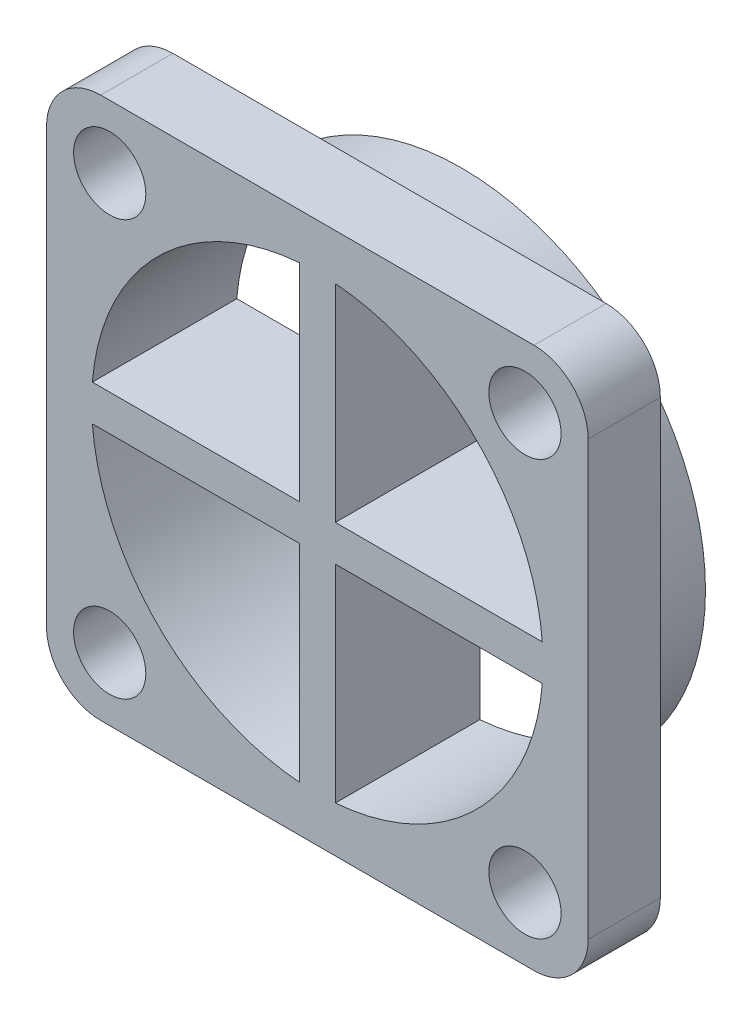
ISO-10303-21;
HEADER;
FILE_DESCRIPTION(('STEP AP214'),'2;1');
FILE_NAME('part.step','',(''),(''),'','','');
FILE_SCHEMA(('AUTOMOTIVE_DESIGN { 1 0 10303 214 1 1 1 1 }'));
ENDSEC;
DATA;
#1=APPLICATION_CONTEXT('core data for automotive mechanical design processes');
#2=APPLICATION_PROTOCOL_DEFINITION('international standard','automotive_design',2000,#1);
#3=PRODUCT_CONTEXT('',#1,'mechanical');
#4=PRODUCT('Part','Part','',(#3));
#5=PRODUCT_RELATED_PRODUCT_CATEGORY('part','',(#4));
#6=PRODUCT_DEFINITION_FORMATION('','',#4);
#7=PRODUCT_DEFINITION_CONTEXT('part definition',#1,'design');
#8=PRODUCT_DEFINITION('design','',#6,#7);
#9=PRODUCT_DEFINITION_SHAPE('','',#8);
#10=(LENGTH_UNIT() NAMED_UNIT(*) SI_UNIT(.MILLI.,.METRE.));
#11=(NAMED_UNIT(*) PLANE_ANGLE_UNIT() SI_UNIT($,.RADIAN.));
#12=(NAMED_UNIT(*) SI_UNIT($,.STERADIAN.) SOLID_ANGLE_UNIT());
#13=UNCERTAINTY_MEASURE_WITH_UNIT(LENGTH_MEASURE(1.E-05),#10,'distance_accuracy_value','');
#14=(GEOMETRIC_REPRESENTATION_CONTEXT(3) GLOBAL_UNCERTAINTY_ASSIGNED_CONTEXT((#13)) GLOBAL_UNIT_ASSIGNED_CONTEXT((#10,
#11,#12)) REPRESENTATION_CONTEXT('',''));
#15=CARTESIAN_POINT('',(0.,0.,0.));
#16=DIRECTION('',(0.,0.,1.));
#17=DIRECTION('',(1.,0.,0.));
#18=AXIS2_PLACEMENT_3D('',#15,#16,#17);
#19=CARTESIAN_POINT('',(0.,0.,8.));
#20=DIRECTION('',(0.,0.,1.));
#21=DIRECTION('',(1.,0.,0.));
#22=AXIS2_PLACEMENT_3D('',#19,#20,#21);
#23=PLANE('',#22);
#24=CARTESIAN_POINT('',(11.5,-11.5,8.));
#25=DIRECTION('',(0.,0.,1.));
#26=DIRECTION('',(1.,0.,0.));
#27=AXIS2_PLACEMENT_3D('',#24,#25,#26);
#28=CIRCLE('',#27,2.);
#29=CARTESIAN_POINT('',(13.5,-11.5,8.));
#30=VERTEX_POINT('',#29);
#31=EDGE_CURVE('E616',#30,#30,#28,.F.);
#32=ORIENTED_EDGE('',*,*,#31,.T.);
#33=EDGE_LOOP('',(#32));
#34=FACE_BOUND('',#33,.T.);
#35=CARTESIAN_POINT('',(11.5,11.5,8.));
#36=DIRECTION('',(0.,0.,1.));
#37=DIRECTION('',(1.,0.,0.));
#38=AXIS2_PLACEMENT_3D('',#35,#36,#37);
#39=CIRCLE('',#38,2.);
#40=CARTESIAN_POINT('',(13.5,11.5,8.));
#41=VERTEX_POINT('',#40);
#42=EDGE_CURVE('E183',#41,#41,#39,.T.);
#43=ORIENTED_EDGE('',*,*,#42,.F.);
#44=EDGE_LOOP('',(#43));
#45=FACE_BOUND('',#44,.T.);
#46=DIRECTION('',(1.,0.,0.));
#47=VECTOR('',#46,1.);
#48=CARTESIAN_POINT('',(-12.4599357943771,1.,8.));
#49=LINE('',#48,#47);
#50=CARTESIAN_POINT('',(-12.4599357943771,1.,8.));
#51=VERTEX_POINT('',#50);
#52=CARTESIAN_POINT('',(-1.,1.,8.));
#53=VERTEX_POINT('',#52);
#54=EDGE_CURVE('E229',#51,#53,#49,.T.);
#55=ORIENTED_EDGE('',*,*,#54,.F.);
#56=CARTESIAN_POINT('',(0.,0.,8.));
#57=DIRECTION('',(0.,0.,1.));
#58=DIRECTION('',(1.,0.,0.));
#59=AXIS2_PLACEMENT_3D('',#56,#57,#58);
#60=CIRCLE('',#59,12.5);
#61=CARTESIAN_POINT('',(-1.,12.4599357943771,8.));
#62=VERTEX_POINT('',#61);
#63=EDGE_CURVE('E225',#62,#51,#60,.T.);
#64=ORIENTED_EDGE('',*,*,#63,.F.);
#65=DIRECTION('',(0.,1.,0.));
#66=VECTOR('',#65,1.);
#67=CARTESIAN_POINT('',(-1.,1.,8.));
#68=LINE('',#67,#66);
#69=EDGE_CURVE('E227',#53,#62,#68,.T.);
#70=ORIENTED_EDGE('',*,*,#69,.F.);
#71=EDGE_LOOP('',(#55,#64,#70));
#72=FACE_BOUND('',#71,.T.);
#73=CARTESIAN_POINT('',(0.,0.,8.));
#74=DIRECTION('',(0.,0.,-1.));
#75=DIRECTION('',(-1.,0.,0.));
#76=AXIS2_PLACEMENT_3D('',#73,#74,#75);
#77=CIRCLE('',#76,12.5);
#78=CARTESIAN_POINT('',(1.,12.4599357943771,8.));
#79=VERTEX_POINT('',#78);
#80=CARTESIAN_POINT('',(12.4599357943771,1.,8.));
#81=VERTEX_POINT('',#80);
#82=EDGE_CURVE('E247',#79,#81,#77,.T.);
#83=ORIENTED_EDGE('',*,*,#82,.T.);
#84=DIRECTION('',(-1.,0.,0.));
#85=VECTOR('',#84,1.);
#86=CARTESIAN_POINT('',(12.4599357943771,1.,8.));
#87=LINE('',#86,#85);
#88=CARTESIAN_POINT('',(1.,1.,8.));
#89=VERTEX_POINT('',#88);
#90=EDGE_CURVE('E250',#81,#89,#87,.T.);
#91=ORIENTED_EDGE('',*,*,#90,.T.);
#92=DIRECTION('',(0.,1.,0.));
#93=VECTOR('',#92,1.);
#94=CARTESIAN_POINT('',(1.,1.,8.));
#95=LINE('',#94,#93);
#96=EDGE_CURVE('E253',#89,#79,#95,.T.);
#97=ORIENTED_EDGE('',*,*,#96,.T.);
#98=EDGE_LOOP('',(#83,#91,#97));
#99=FACE_BOUND('',#98,.T.);
#100=DIRECTION('',(1.,0.,0.));
#101=VECTOR('',#100,1.);
#102=CARTESIAN_POINT('',(-15.,-15.,8.));
#103=LINE('',#102,#101);
#104=CARTESIAN_POINT('',(-12.,-15.,8.));
#105=VERTEX_POINT('',#104);
#106=CARTESIAN_POINT('',(12.,-15.,8.));
#107=VERTEX_POINT('',#106);
#108=EDGE_CURVE('E284',#105,#107,#103,.T.);
#109=ORIENTED_EDGE('',*,*,#108,.T.);
#110=CARTESIAN_POINT('',(12.,-12.,8.));
#111=DIRECTION('',(0.,0.,1.));
#112=DIRECTION('',(1.,0.,0.));
#113=AXIS2_PLACEMENT_3D('',#110,#111,#112);
#114=CIRCLE('',#113,3.);
#115=CARTESIAN_POINT('',(15.,-12.,8.));
#116=VERTEX_POINT('',#115);
#117=EDGE_CURVE('E327',#107,#116,#114,.T.);
#118=ORIENTED_EDGE('',*,*,#117,.T.);
#119=DIRECTION('',(0.,1.,0.));
#120=VECTOR('',#119,1.);
#121=CARTESIAN_POINT('',(15.,15.,8.));
#122=LINE('',#121,#120);
#123=CARTESIAN_POINT('',(15.,12.,8.));
#124=VERTEX_POINT('',#123);
#125=EDGE_CURVE('E274',#116,#124,#122,.T.);
#126=ORIENTED_EDGE('',*,*,#125,.T.);
#127=CARTESIAN_POINT('',(12.,12.,8.));
#128=DIRECTION('',(0.,0.,1.));
#129=DIRECTION('',(1.,0.,0.));
#130=AXIS2_PLACEMENT_3D('',#127,#128,#129);
#131=CIRCLE('',#130,3.);
#132=CARTESIAN_POINT('',(12.,15.,8.));
#133=VERTEX_POINT('',#132);
#134=EDGE_CURVE('E321',#124,#133,#131,.T.);
#135=ORIENTED_EDGE('',*,*,#134,.T.);
#136=DIRECTION('',(-1.,0.,0.));
#137=VECTOR('',#136,1.);
#138=CARTESIAN_POINT('',(-15.,15.,8.));
#139=LINE('',#138,#137);
#140=CARTESIAN_POINT('',(-12.,15.,8.));
#141=VERTEX_POINT('',#140);
#142=EDGE_CURVE('E277',#133,#141,#139,.T.);
#143=ORIENTED_EDGE('',*,*,#142,.T.);
#144=CARTESIAN_POINT('',(-12.,12.,8.));
#145=DIRECTION('',(0.,0.,1.));
#146=DIRECTION('',(1.,0.,0.));
#147=AXIS2_PLACEMENT_3D('',#144,#145,#146);
#148=CIRCLE('',#147,3.);
#149=CARTESIAN_POINT('',(-15.,12.,8.));
#150=VERTEX_POINT('',#149);
#151=EDGE_CURVE('E323',#141,#150,#148,.T.);
#152=ORIENTED_EDGE('',*,*,#151,.T.);
#153=DIRECTION('',(0.,-1.,0.));
#154=VECTOR('',#153,1.);
#155=CARTESIAN_POINT('',(-15.,15.,8.));
#156=LINE('',#155,#154);
#157=CARTESIAN_POINT('',(-15.,-12.,8.));
#158=VERTEX_POINT('',#157);
#159=EDGE_CURVE('E281',#150,#158,#156,.T.);
#160=ORIENTED_EDGE('',*,*,#159,.T.);
#161=CARTESIAN_POINT('',(-12.,-12.,8.));
#162=DIRECTION('',(0.,0.,1.));
#163=DIRECTION('',(1.,0.,0.));
#164=AXIS2_PLACEMENT_3D('',#161,#162,#163);
#165=CIRCLE('',#164,3.);
#166=EDGE_CURVE('E325',#158,#105,#165,.T.);
#167=ORIENTED_EDGE('',*,*,#166,.T.);
#168=EDGE_LOOP('',(#109,#118,#126,#135,#143,#152,#160,#167));
#169=FACE_BOUND('',#168,.T.);
#170=CARTESIAN_POINT('',(0.,0.,8.));
#171=DIRECTION('',(0.,0.,-1.));
#172=DIRECTION('',(1.,0.,0.));
#173=AXIS2_PLACEMENT_3D('',#170,#171,#172);
#174=CIRCLE('',#173,12.5);
#175=CARTESIAN_POINT('',(-1.,-12.4599357943771,8.));
#176=VERTEX_POINT('',#175);
#177=CARTESIAN_POINT('',(-12.4599357943771,-1.,8.));
#178=VERTEX_POINT('',#177);
#179=EDGE_CURVE('E199',#176,#178,#174,.T.);
#180=ORIENTED_EDGE('',*,*,#179,.T.);
#181=DIRECTION('',(1.,0.,0.));
#182=VECTOR('',#181,1.);
#183=CARTESIAN_POINT('',(-12.4599357943771,-1.,8.));
#184=LINE('',#183,#182);
#185=CARTESIAN_POINT('',(-1.,-1.,8.));
#186=VERTEX_POINT('',#185);
#187=EDGE_CURVE('E202',#178,#186,#184,.T.);
#188=ORIENTED_EDGE('',*,*,#187,.T.);
#189=DIRECTION('',(0.,-1.,0.));
#190=VECTOR('',#189,1.);
#191=CARTESIAN_POINT('',(-1.,-1.,8.));
#192=LINE('',#191,#190);
#193=EDGE_CURVE('E205',#186,#176,#192,.T.);
#194=ORIENTED_EDGE('',*,*,#193,.T.);
#195=EDGE_LOOP('',(#180,#188,#194));
#196=FACE_BOUND('',#195,.T.);
#197=DIRECTION('',(-1.,0.,0.));
#198=VECTOR('',#197,1.);
#199=CARTESIAN_POINT('',(12.4599357943771,-1.,8.));
#200=LINE('',#199,#198);
#201=CARTESIAN_POINT('',(12.4599357943771,-1.,8.));
#202=VERTEX_POINT('',#201);
#203=CARTESIAN_POINT('',(1.,-1.,8.));
#204=VERTEX_POINT('',#203);
#205=EDGE_CURVE('E171',#202,#204,#200,.T.);
#206=ORIENTED_EDGE('',*,*,#205,.F.);
#207=CARTESIAN_POINT('',(0.,0.,8.));
#208=DIRECTION('',(0.,0.,1.));
#209=DIRECTION('',(-1.,0.,0.));
#210=AXIS2_PLACEMENT_3D('',#207,#208,#209);
#211=CIRCLE('',#210,12.5);
#212=CARTESIAN_POINT('',(1.,-12.4599357943771,8.));
#213=VERTEX_POINT('',#212);
#214=EDGE_CURVE('E172',#213,#202,#211,.T.);
#215=ORIENTED_EDGE('',*,*,#214,.F.);
#216=DIRECTION('',(0.,-1.,0.));
#217=VECTOR('',#216,1.);
#218=CARTESIAN_POINT('',(1.,-1.,8.));
#219=LINE('',#218,#217);
#220=EDGE_CURVE('E166',#204,#213,#219,.T.);
#221=ORIENTED_EDGE('',*,*,#220,.F.);
#222=EDGE_LOOP('',(#206,#215,#221));
#223=FACE_BOUND('',#222,.T.);
#224=CARTESIAN_POINT('',(-11.5,-11.5,8.));
#225=DIRECTION('',(0.,0.,1.));
#226=DIRECTION('',(1.,0.,0.));
#227=AXIS2_PLACEMENT_3D('',#224,#225,#226);
#228=CIRCLE('',#227,2.);
#229=CARTESIAN_POINT('',(-9.5,-11.5,8.));
#230=VERTEX_POINT('',#229);
#231=EDGE_CURVE('E610',#230,#230,#228,.T.);
#232=ORIENTED_EDGE('',*,*,#231,.F.);
#233=EDGE_LOOP('',(#232));
#234=FACE_BOUND('',#233,.T.);
#235=CARTESIAN_POINT('',(-11.5,11.5,8.));
#236=DIRECTION('',(0.,0.,1.));
#237=DIRECTION('',(1.,0.,0.));
#238=AXIS2_PLACEMENT_3D('',#235,#236,#237);
#239=CIRCLE('',#238,2.);
#240=CARTESIAN_POINT('',(-9.5,11.5,8.));
#241=VERTEX_POINT('',#240);
#242=EDGE_CURVE('E599',#241,#241,#239,.F.);
#243=ORIENTED_EDGE('',*,*,#242,.T.);
#244=EDGE_LOOP('',(#243));
#245=FACE_BOUND('',#244,.T.);
#246=ADVANCED_FACE('F33',(#34,#45,#72,#99,#169,#196,#223,#234,#245),#23,.T.);
#247=CARTESIAN_POINT('',(0.,0.,4.));
#248=DIRECTION('',(0.,0.,1.));
#249=DIRECTION('',(1.,0.,0.));
#250=AXIS2_PLACEMENT_3D('',#247,#248,#249);
#251=PLANE('',#250);
#252=CARTESIAN_POINT('',(11.5,-11.5,4.));
#253=DIRECTION('',(0.,0.,1.));
#254=DIRECTION('',(-1.,0.,0.));
#255=AXIS2_PLACEMENT_3D('',#252,#253,#254);
#256=CIRCLE('',#255,2.);
#257=CARTESIAN_POINT('',(9.5,-11.5,4.));
#258=VERTEX_POINT('',#257);
#259=EDGE_CURVE('E613',#258,#258,#256,.T.);
#260=ORIENTED_EDGE('',*,*,#259,.T.);
#261=EDGE_LOOP('',(#260));
#262=FACE_BOUND('',#261,.T.);
#263=CARTESIAN_POINT('',(11.5,11.5,4.));
#264=DIRECTION('',(0.,0.,-1.));
#265=DIRECTION('',(-1.,0.,0.));
#266=AXIS2_PLACEMENT_3D('',#263,#264,#265);
#267=CIRCLE('',#266,2.);
#268=CARTESIAN_POINT('',(9.5,11.5,4.));
#269=VERTEX_POINT('',#268);
#270=EDGE_CURVE('E186',#269,#269,#267,.T.);
#271=ORIENTED_EDGE('',*,*,#270,.F.);
#272=EDGE_LOOP('',(#271));
#273=FACE_BOUND('',#272,.T.);
#274=DIRECTION('',(0.,1.,0.));
#275=VECTOR('',#274,1.);
#276=CARTESIAN_POINT('',(15.,15.,4.));
#277=LINE('',#276,#275);
#278=CARTESIAN_POINT('',(15.,-12.,4.));
#279=VERTEX_POINT('',#278);
#280=CARTESIAN_POINT('',(15.,12.,4.));
#281=VERTEX_POINT('',#280);
#282=EDGE_CURVE('E273',#279,#281,#277,.T.);
#283=ORIENTED_EDGE('',*,*,#282,.F.);
#284=CARTESIAN_POINT('',(12.,-12.,4.));
#285=DIRECTION('',(0.,0.,1.));
#286=DIRECTION('',(1.,0.,0.));
#287=AXIS2_PLACEMENT_3D('',#284,#285,#286);
#288=CIRCLE('',#287,3.);
#289=CARTESIAN_POINT('',(12.,-15.,4.));
#290=VERTEX_POINT('',#289);
#291=EDGE_CURVE('E314',#279,#290,#288,.F.);
#292=ORIENTED_EDGE('',*,*,#291,.T.);
#293=DIRECTION('',(1.,0.,0.));
#294=VECTOR('',#293,1.);
#295=CARTESIAN_POINT('',(-15.,-15.,4.));
#296=LINE('',#295,#294);
#297=CARTESIAN_POINT('',(-12.,-15.,4.));
#298=VERTEX_POINT('',#297);
#299=EDGE_CURVE('E278',#298,#290,#296,.T.);
#300=ORIENTED_EDGE('',*,*,#299,.F.);
#301=CARTESIAN_POINT('',(-12.,-12.,4.));
#302=DIRECTION('',(0.,0.,1.));
#303=DIRECTION('',(1.,0.,0.));
#304=AXIS2_PLACEMENT_3D('',#301,#302,#303);
#305=CIRCLE('',#304,3.);
#306=CARTESIAN_POINT('',(-15.,-12.,4.));
#307=VERTEX_POINT('',#306);
#308=EDGE_CURVE('E312',#298,#307,#305,.F.);
#309=ORIENTED_EDGE('',*,*,#308,.T.);
#310=DIRECTION('',(0.,-1.,0.));
#311=VECTOR('',#310,1.);
#312=CARTESIAN_POINT('',(-15.,15.,4.));
#313=LINE('',#312,#311);
#314=CARTESIAN_POINT('',(-15.,12.,4.));
#315=VERTEX_POINT('',#314);
#316=EDGE_CURVE('E293',#315,#307,#313,.T.);
#317=ORIENTED_EDGE('',*,*,#316,.F.);
#318=CARTESIAN_POINT('',(-12.,12.,4.));
#319=DIRECTION('',(0.,0.,1.));
#320=DIRECTION('',(1.,0.,0.));
#321=AXIS2_PLACEMENT_3D('',#318,#319,#320);
#322=CIRCLE('',#321,3.);
#323=CARTESIAN_POINT('',(-12.,15.,4.));
#324=VERTEX_POINT('',#323);
#325=EDGE_CURVE('E310',#315,#324,#322,.F.);
#326=ORIENTED_EDGE('',*,*,#325,.T.);
#327=DIRECTION('',(-1.,0.,0.));
#328=VECTOR('',#327,1.);
#329=CARTESIAN_POINT('',(-15.,15.,4.));
#330=LINE('',#329,#328);
#331=CARTESIAN_POINT('',(12.,15.,4.));
#332=VERTEX_POINT('',#331);
#333=EDGE_CURVE('E290',#332,#324,#330,.T.);
#334=ORIENTED_EDGE('',*,*,#333,.F.);
#335=CARTESIAN_POINT('',(12.,12.,4.));
#336=DIRECTION('',(0.,0.,1.));
#337=DIRECTION('',(1.,0.,0.));
#338=AXIS2_PLACEMENT_3D('',#335,#336,#337);
#339=CIRCLE('',#338,3.);
#340=EDGE_CURVE('E308',#332,#281,#339,.F.);
#341=ORIENTED_EDGE('',*,*,#340,.T.);
#342=EDGE_LOOP('',(#283,#292,#300,#309,#317,#326,#334,#341));
#343=FACE_BOUND('',#342,.T.);
#344=CARTESIAN_POINT('',(0.,0.,4.));
#345=DIRECTION('',(0.,0.,1.));
#346=DIRECTION('',(1.,0.,0.));
#347=AXIS2_PLACEMENT_3D('',#344,#345,#346);
#348=CIRCLE('',#347,13.5);
#349=CARTESIAN_POINT('',(13.5,0.,4.));
#350=VERTEX_POINT('',#349);
#351=EDGE_CURVE('E298',#350,#350,#348,.T.);
#352=ORIENTED_EDGE('',*,*,#351,.T.);
#353=EDGE_LOOP('',(#352));
#354=FACE_BOUND('',#353,.T.);
#355=CARTESIAN_POINT('',(-11.5,-11.5,4.));
#356=DIRECTION('',(0.,0.,-1.));
#357=DIRECTION('',(1.,0.,0.));
#358=AXIS2_PLACEMENT_3D('',#355,#356,#357);
#359=CIRCLE('',#358,2.);
#360=CARTESIAN_POINT('',(-9.5,-11.5,4.));
#361=VERTEX_POINT('',#360);
#362=EDGE_CURVE('E605',#361,#361,#359,.T.);
#363=ORIENTED_EDGE('',*,*,#362,.F.);
#364=EDGE_LOOP('',(#363));
#365=FACE_BOUND('',#364,.T.);
#366=CARTESIAN_POINT('',(-11.5,11.5,4.));
#367=DIRECTION('',(0.,0.,1.));
#368=DIRECTION('',(1.,0.,0.));
#369=AXIS2_PLACEMENT_3D('',#366,#367,#368);
#370=CIRCLE('',#369,2.);
#371=CARTESIAN_POINT('',(-9.5,11.5,4.));
#372=VERTEX_POINT('',#371);
#373=EDGE_CURVE('E602',#372,#372,#370,.T.);
#374=ORIENTED_EDGE('',*,*,#373,.T.);
#375=EDGE_LOOP('',(#374));
#376=FACE_BOUND('',#375,.T.);
#377=ADVANCED_FACE('F344',(#262,#273,#343,#354,#365,#376),#251,.F.);
#378=CARTESIAN_POINT('',(0.,0.,0.));
#379=DIRECTION('',(0.,0.,1.));
#380=DIRECTION('',(1.,0.,0.));
#381=AXIS2_PLACEMENT_3D('',#378,#379,#380);
#382=PLANE('',#381);
#383=CARTESIAN_POINT('',(0.,0.,0.));
#384=DIRECTION('',(0.,0.,1.));
#385=DIRECTION('',(1.,0.,0.));
#386=AXIS2_PLACEMENT_3D('',#383,#384,#385);
#387=CIRCLE('',#386,12.5);
#388=CARTESIAN_POINT('',(-12.4599357943771,1.,0.));
#389=VERTEX_POINT('',#388);
#390=CARTESIAN_POINT('',(-1.,12.4599357943771,0.));
#391=VERTEX_POINT('',#390);
#392=EDGE_CURVE('E244',#389,#391,#387,.F.);
#393=ORIENTED_EDGE('',*,*,#392,.F.);
#394=DIRECTION('',(-1.,0.,0.));
#395=VECTOR('',#394,1.);
#396=CARTESIAN_POINT('',(0.,1.,0.));
#397=LINE('',#396,#395);
#398=CARTESIAN_POINT('',(-1.,1.,0.));
#399=VERTEX_POINT('',#398);
#400=EDGE_CURVE('E242',#399,#389,#397,.T.);
#401=ORIENTED_EDGE('',*,*,#400,.F.);
#402=DIRECTION('',(0.,-1.,0.));
#403=VECTOR('',#402,1.);
#404=CARTESIAN_POINT('',(-1.,0.,0.));
#405=LINE('',#404,#403);
#406=EDGE_CURVE('E236',#391,#399,#405,.T.);
#407=ORIENTED_EDGE('',*,*,#406,.F.);
#408=EDGE_LOOP('',(#393,#401,#407));
#409=FACE_BOUND('',#408,.T.);
#410=DIRECTION('',(1.,0.,0.));
#411=VECTOR('',#410,1.);
#412=CARTESIAN_POINT('',(0.,1.,0.));
#413=LINE('',#412,#411);
#414=CARTESIAN_POINT('',(1.,1.,0.));
#415=VERTEX_POINT('',#414);
#416=CARTESIAN_POINT('',(12.4599357943771,1.,0.));
#417=VERTEX_POINT('',#416);
#418=EDGE_CURVE('E260',#415,#417,#413,.T.);
#419=ORIENTED_EDGE('',*,*,#418,.T.);
#420=CARTESIAN_POINT('',(0.,0.,0.));
#421=DIRECTION('',(0.,0.,1.));
#422=DIRECTION('',(1.,0.,0.));
#423=AXIS2_PLACEMENT_3D('',#420,#421,#422);
#424=CIRCLE('',#423,12.5);
#425=CARTESIAN_POINT('',(1.,12.4599357943771,0.));
#426=VERTEX_POINT('',#425);
#427=EDGE_CURVE('E270',#417,#426,#424,.T.);
#428=ORIENTED_EDGE('',*,*,#427,.T.);
#429=DIRECTION('',(0.,-1.,0.));
#430=VECTOR('',#429,1.);
#431=CARTESIAN_POINT('',(1.,0.,0.));
#432=LINE('',#431,#430);
#433=EDGE_CURVE('E267',#426,#415,#432,.T.);
#434=ORIENTED_EDGE('',*,*,#433,.T.);
#435=EDGE_LOOP('',(#419,#428,#434));
#436=FACE_BOUND('',#435,.T.);
#437=CARTESIAN_POINT('',(0.,0.,0.));
#438=DIRECTION('',(0.,0.,1.));
#439=DIRECTION('',(1.,0.,0.));
#440=AXIS2_PLACEMENT_3D('',#437,#438,#439);
#441=CIRCLE('',#440,13.5);
#442=CARTESIAN_POINT('',(13.5,0.,0.));
#443=VERTEX_POINT('',#442);
#444=EDGE_CURVE('E287',#443,#443,#441,.T.);
#445=ORIENTED_EDGE('',*,*,#444,.F.);
#446=EDGE_LOOP('',(#445));
#447=FACE_BOUND('',#446,.T.);
#448=DIRECTION('',(-1.,0.,0.));
#449=VECTOR('',#448,1.);
#450=CARTESIAN_POINT('',(0.,-1.,0.));
#451=LINE('',#450,#449);
#452=CARTESIAN_POINT('',(-1.,-1.,0.));
#453=VERTEX_POINT('',#452);
#454=CARTESIAN_POINT('',(-12.4599357943771,-1.,0.));
#455=VERTEX_POINT('',#454);
#456=EDGE_CURVE('E212',#453,#455,#451,.T.);
#457=ORIENTED_EDGE('',*,*,#456,.T.);
#458=CARTESIAN_POINT('',(0.,0.,0.));
#459=DIRECTION('',(0.,0.,1.));
#460=DIRECTION('',(1.,0.,0.));
#461=AXIS2_PLACEMENT_3D('',#458,#459,#460);
#462=CIRCLE('',#461,12.5);
#463=CARTESIAN_POINT('',(-1.,-12.4599357943771,0.));
#464=VERTEX_POINT('',#463);
#465=EDGE_CURVE('E222',#455,#464,#462,.T.);
#466=ORIENTED_EDGE('',*,*,#465,.T.);
#467=DIRECTION('',(0.,1.,0.));
#468=VECTOR('',#467,1.);
#469=CARTESIAN_POINT('',(-1.,0.,0.));
#470=LINE('',#469,#468);
#471=EDGE_CURVE('E219',#464,#453,#470,.T.);
#472=ORIENTED_EDGE('',*,*,#471,.T.);
#473=EDGE_LOOP('',(#457,#466,#472));
#474=FACE_BOUND('',#473,.T.);
#475=CARTESIAN_POINT('',(0.,0.,0.));
#476=DIRECTION('',(0.,0.,1.));
#477=DIRECTION('',(1.,0.,0.));
#478=AXIS2_PLACEMENT_3D('',#475,#476,#477);
#479=CIRCLE('',#478,12.5);
#480=CARTESIAN_POINT('',(12.4599357943771,-1.,0.));
#481=VERTEX_POINT('',#480);
#482=CARTESIAN_POINT('',(1.,-12.4599357943771,0.));
#483=VERTEX_POINT('',#482);
#484=EDGE_CURVE('E179',#481,#483,#479,.F.);
#485=ORIENTED_EDGE('',*,*,#484,.F.);
#486=DIRECTION('',(1.,0.,0.));
#487=VECTOR('',#486,1.);
#488=CARTESIAN_POINT('',(0.,-1.,0.));
#489=LINE('',#488,#487);
#490=CARTESIAN_POINT('',(1.,-1.,0.));
#491=VERTEX_POINT('',#490);
#492=EDGE_CURVE('E196',#491,#481,#489,.T.);
#493=ORIENTED_EDGE('',*,*,#492,.F.);
#494=DIRECTION('',(0.,1.,0.));
#495=VECTOR('',#494,1.);
#496=CARTESIAN_POINT('',(1.,0.,0.));
#497=LINE('',#496,#495);
#498=EDGE_CURVE('E193',#483,#491,#497,.T.);
#499=ORIENTED_EDGE('',*,*,#498,.F.);
#500=EDGE_LOOP('',(#485,#493,#499));
#501=FACE_BOUND('',#500,.T.);
#502=ADVANCED_FACE('F389',(#409,#436,#447,#474,#501),#382,.F.);
#503=CARTESIAN_POINT('',(0.,0.,4.));
#504=DIRECTION('',(0.,0.,-1.));
#505=DIRECTION('',(-1.,0.,0.));
#506=AXIS2_PLACEMENT_3D('',#503,#504,#505);
#507=CYLINDRICAL_SURFACE('',#506,13.5);
#508=ORIENTED_EDGE('',*,*,#351,.F.);
#509=EDGE_LOOP('',(#508));
#510=FACE_BOUND('',#509,.T.);
#511=ORIENTED_EDGE('',*,*,#444,.T.);
#512=EDGE_LOOP('',(#511));
#513=FACE_BOUND('',#512,.T.);
#514=ADVANCED_FACE('F404',(#510,#513),#507,.T.);
#515=CARTESIAN_POINT('',(15.,15.,8.));
#516=DIRECTION('',(-1.,0.,0.));
#517=DIRECTION('',(0.,-1.,0.));
#518=AXIS2_PLACEMENT_3D('',#515,#516,#517);
#519=PLANE('',#518);
#520=ORIENTED_EDGE('',*,*,#125,.F.);
#521=DIRECTION('',(0.,0.,-1.));
#522=VECTOR('',#521,1.);
#523=CARTESIAN_POINT('',(15.,-12.,8.));
#524=LINE('',#523,#522);
#525=EDGE_CURVE('E305',#116,#279,#524,.T.);
#526=ORIENTED_EDGE('',*,*,#525,.T.);
#527=ORIENTED_EDGE('',*,*,#282,.T.);
#528=DIRECTION('',(0.,0.,-1.));
#529=VECTOR('',#528,1.);
#530=CARTESIAN_POINT('',(15.,12.,8.));
#531=LINE('',#530,#529);
#532=EDGE_CURVE('E301',#281,#124,#531,.F.);
#533=ORIENTED_EDGE('',*,*,#532,.T.);
#534=EDGE_LOOP('',(#520,#526,#527,#533));
#535=FACE_BOUND('',#534,.T.);
#536=ADVANCED_FACE('F372',(#535),#519,.F.);
#537=CARTESIAN_POINT('',(-15.,15.,8.));
#538=DIRECTION('',(0.,-1.,0.));
#539=DIRECTION('',(0.,0.,-1.));
#540=AXIS2_PLACEMENT_3D('',#537,#538,#539);
#541=PLANE('',#540);
#542=ORIENTED_EDGE('',*,*,#333,.T.);
#543=DIRECTION('',(0.,0.,-1.));
#544=VECTOR('',#543,1.);
#545=CARTESIAN_POINT('',(-12.,15.,8.));
#546=LINE('',#545,#544);
#547=EDGE_CURVE('E11',#324,#141,#546,.F.);
#548=ORIENTED_EDGE('',*,*,#547,.T.);
#549=ORIENTED_EDGE('',*,*,#142,.F.);
#550=DIRECTION('',(0.,0.,-1.));
#551=VECTOR('',#550,1.);
#552=CARTESIAN_POINT('',(12.,15.,8.));
#553=LINE('',#552,#551);
#554=EDGE_CURVE('E41',#133,#332,#553,.T.);
#555=ORIENTED_EDGE('',*,*,#554,.T.);
#556=EDGE_LOOP('',(#542,#548,#549,#555));
#557=FACE_BOUND('',#556,.T.);
#558=ADVANCED_FACE('F338',(#557),#541,.F.);
#559=CARTESIAN_POINT('',(-15.,15.,8.));
#560=DIRECTION('',(1.,0.,0.));
#561=DIRECTION('',(0.,1.,0.));
#562=AXIS2_PLACEMENT_3D('',#559,#560,#561);
#563=PLANE('',#562);
#564=ORIENTED_EDGE('',*,*,#316,.T.);
#565=DIRECTION('',(0.,0.,-1.));
#566=VECTOR('',#565,1.);
#567=CARTESIAN_POINT('',(-15.,-12.,8.));
#568=LINE('',#567,#566);
#569=EDGE_CURVE('E332',#307,#158,#568,.F.);
#570=ORIENTED_EDGE('',*,*,#569,.T.);
#571=ORIENTED_EDGE('',*,*,#159,.F.);
#572=DIRECTION('',(0.,0.,-1.));
#573=VECTOR('',#572,1.);
#574=CARTESIAN_POINT('',(-15.,12.,8.));
#575=LINE('',#574,#573);
#576=EDGE_CURVE('E329',#150,#315,#575,.T.);
#577=ORIENTED_EDGE('',*,*,#576,.T.);
#578=EDGE_LOOP('',(#564,#570,#571,#577));
#579=FACE_BOUND('',#578,.T.);
#580=ADVANCED_FACE('F353',(#579),#563,.F.);
#581=CARTESIAN_POINT('',(-15.,-15.,8.));
#582=DIRECTION('',(0.,1.,0.));
#583=DIRECTION('',(0.,0.,1.));
#584=AXIS2_PLACEMENT_3D('',#581,#582,#583);
#585=PLANE('',#584);
#586=ORIENTED_EDGE('',*,*,#299,.T.);
#587=DIRECTION('',(0.,0.,-1.));
#588=VECTOR('',#587,1.);
#589=CARTESIAN_POINT('',(12.,-15.,8.));
#590=LINE('',#589,#588);
#591=EDGE_CURVE('E319',#290,#107,#590,.F.);
#592=ORIENTED_EDGE('',*,*,#591,.T.);
#593=ORIENTED_EDGE('',*,*,#108,.F.);
#594=DIRECTION('',(0.,0.,-1.));
#595=VECTOR('',#594,1.);
#596=CARTESIAN_POINT('',(-12.,-15.,8.));
#597=LINE('',#596,#595);
#598=EDGE_CURVE('E316',#105,#298,#597,.T.);
#599=ORIENTED_EDGE('',*,*,#598,.T.);
#600=EDGE_LOOP('',(#586,#592,#593,#599));
#601=FACE_BOUND('',#600,.T.);
#602=ADVANCED_FACE('F364',(#601),#585,.F.);
#603=CARTESIAN_POINT('',(12.,-12.,8.));
#604=DIRECTION('',(0.,0.,-1.));
#605=DIRECTION('',(-1.,0.,0.));
#606=AXIS2_PLACEMENT_3D('',#603,#604,#605);
#607=CYLINDRICAL_SURFACE('',#606,3.);
#608=ORIENTED_EDGE('',*,*,#117,.F.);
#609=ORIENTED_EDGE('',*,*,#591,.F.);
#610=ORIENTED_EDGE('',*,*,#291,.F.);
#611=ORIENTED_EDGE('',*,*,#525,.F.);
#612=EDGE_LOOP('',(#608,#609,#610,#611));
#613=FACE_BOUND('',#612,.T.);
#614=ADVANCED_FACE('F369',(#613),#607,.T.);
#615=CARTESIAN_POINT('',(-12.,-12.,8.));
#616=DIRECTION('',(0.,0.,-1.));
#617=DIRECTION('',(-1.,0.,0.));
#618=AXIS2_PLACEMENT_3D('',#615,#616,#617);
#619=CYLINDRICAL_SURFACE('',#618,3.);
#620=ORIENTED_EDGE('',*,*,#166,.F.);
#621=ORIENTED_EDGE('',*,*,#569,.F.);
#622=ORIENTED_EDGE('',*,*,#308,.F.);
#623=ORIENTED_EDGE('',*,*,#598,.F.);
#624=EDGE_LOOP('',(#620,#621,#622,#623));
#625=FACE_BOUND('',#624,.T.);
#626=ADVANCED_FACE('F361',(#625),#619,.T.);
#627=CARTESIAN_POINT('',(-12.,12.,8.));
#628=DIRECTION('',(0.,0.,-1.));
#629=DIRECTION('',(-1.,0.,0.));
#630=AXIS2_PLACEMENT_3D('',#627,#628,#629);
#631=CYLINDRICAL_SURFACE('',#630,3.);
#632=ORIENTED_EDGE('',*,*,#151,.F.);
#633=ORIENTED_EDGE('',*,*,#547,.F.);
#634=ORIENTED_EDGE('',*,*,#325,.F.);
#635=ORIENTED_EDGE('',*,*,#576,.F.);
#636=EDGE_LOOP('',(#632,#633,#634,#635));
#637=FACE_BOUND('',#636,.T.);
#638=ADVANCED_FACE('F350',(#637),#631,.T.);
#639=CARTESIAN_POINT('',(12.,12.,8.));
#640=DIRECTION('',(0.,0.,-1.));
#641=DIRECTION('',(-1.,0.,0.));
#642=AXIS2_PLACEMENT_3D('',#639,#640,#641);
#643=CYLINDRICAL_SURFACE('',#642,3.);
#644=ORIENTED_EDGE('',*,*,#134,.F.);
#645=ORIENTED_EDGE('',*,*,#532,.F.);
#646=ORIENTED_EDGE('',*,*,#340,.F.);
#647=ORIENTED_EDGE('',*,*,#554,.F.);
#648=EDGE_LOOP('',(#644,#645,#646,#647));
#649=FACE_BOUND('',#648,.T.);
#650=ADVANCED_FACE('F35',(#649),#643,.T.);
#651=CARTESIAN_POINT('',(0.,0.,8.));
#652=DIRECTION('',(0.,0.,-1.));
#653=DIRECTION('',(-1.,0.,0.));
#654=AXIS2_PLACEMENT_3D('',#651,#652,#653);
#655=CYLINDRICAL_SURFACE('',#654,12.5);
#656=DIRECTION('',(0.,0.,-1.));
#657=VECTOR('',#656,1.);
#658=CARTESIAN_POINT('',(12.4599357943771,1.,8.));
#659=LINE('',#658,#657);
#660=EDGE_CURVE('E256',#81,#417,#659,.T.);
#661=ORIENTED_EDGE('',*,*,#660,.F.);
#662=ORIENTED_EDGE('',*,*,#82,.F.);
#663=DIRECTION('',(0.,0.,-1.));
#664=VECTOR('',#663,1.);
#665=CARTESIAN_POINT('',(1.,12.4599357943771,8.));
#666=LINE('',#665,#664);
#667=EDGE_CURVE('E257',#79,#426,#666,.T.);
#668=ORIENTED_EDGE('',*,*,#667,.T.);
#669=ORIENTED_EDGE('',*,*,#427,.F.);
#670=EDGE_LOOP('',(#661,#662,#668,#669));
#671=FACE_BOUND('',#670,.T.);
#672=ADVANCED_FACE('F375',(#671),#655,.F.);
#673=CARTESIAN_POINT('',(1.,1.,8.));
#674=DIRECTION('',(-1.,0.,0.));
#675=DIRECTION('',(0.,-1.,0.));
#676=AXIS2_PLACEMENT_3D('',#673,#674,#675);
#677=PLANE('',#676);
#678=ORIENTED_EDGE('',*,*,#667,.F.);
#679=ORIENTED_EDGE('',*,*,#96,.F.);
#680=DIRECTION('',(0.,0.,-1.));
#681=VECTOR('',#680,1.);
#682=CARTESIAN_POINT('',(1.,1.,8.));
#683=LINE('',#682,#681);
#684=EDGE_CURVE('E261',#89,#415,#683,.T.);
#685=ORIENTED_EDGE('',*,*,#684,.T.);
#686=ORIENTED_EDGE('',*,*,#433,.F.);
#687=EDGE_LOOP('',(#678,#679,#685,#686));
#688=FACE_BOUND('',#687,.T.);
#689=ADVANCED_FACE('F380',(#688),#677,.F.);
#690=CARTESIAN_POINT('',(12.4599357943771,1.,8.));
#691=DIRECTION('',(0.,-1.,0.));
#692=DIRECTION('',(1.,0.,0.));
#693=AXIS2_PLACEMENT_3D('',#690,#691,#692);
#694=PLANE('',#693);
#695=ORIENTED_EDGE('',*,*,#684,.F.);
#696=ORIENTED_EDGE('',*,*,#90,.F.);
#697=ORIENTED_EDGE('',*,*,#660,.T.);
#698=ORIENTED_EDGE('',*,*,#418,.F.);
#699=EDGE_LOOP('',(#695,#696,#697,#698));
#700=FACE_BOUND('',#699,.T.);
#701=ADVANCED_FACE('F441',(#700),#694,.F.);
#702=CARTESIAN_POINT('',(0.,0.,8.));
#703=DIRECTION('',(0.,0.,-1.));
#704=DIRECTION('',(-1.,0.,0.));
#705=AXIS2_PLACEMENT_3D('',#702,#703,#704);
#706=CYLINDRICAL_SURFACE('',#705,12.5);
#707=ORIENTED_EDGE('',*,*,#392,.T.);
#708=DIRECTION('',(0.,0.,-1.));
#709=VECTOR('',#708,1.);
#710=CARTESIAN_POINT('',(-1.,12.4599357943771,8.));
#711=LINE('',#710,#709);
#712=EDGE_CURVE('E232',#62,#391,#711,.T.);
#713=ORIENTED_EDGE('',*,*,#712,.F.);
#714=ORIENTED_EDGE('',*,*,#63,.T.);
#715=DIRECTION('',(0.,0.,-1.));
#716=VECTOR('',#715,1.);
#717=CARTESIAN_POINT('',(-12.4599357943771,1.,8.));
#718=LINE('',#717,#716);
#719=EDGE_CURVE('E233',#51,#389,#718,.T.);
#720=ORIENTED_EDGE('',*,*,#719,.T.);
#721=EDGE_LOOP('',(#707,#713,#714,#720));
#722=FACE_BOUND('',#721,.T.);
#723=ADVANCED_FACE('F451',(#722),#706,.F.);
#724=CARTESIAN_POINT('',(-12.4599357943771,1.,8.));
#725=DIRECTION('',(0.,1.,0.));
#726=DIRECTION('',(-1.,0.,0.));
#727=AXIS2_PLACEMENT_3D('',#724,#725,#726);
#728=PLANE('',#727);
#729=ORIENTED_EDGE('',*,*,#400,.T.);
#730=ORIENTED_EDGE('',*,*,#719,.F.);
#731=ORIENTED_EDGE('',*,*,#54,.T.);
#732=DIRECTION('',(0.,0.,-1.));
#733=VECTOR('',#732,1.);
#734=CARTESIAN_POINT('',(-1.,1.,8.));
#735=LINE('',#734,#733);
#736=EDGE_CURVE('E237',#53,#399,#735,.T.);
#737=ORIENTED_EDGE('',*,*,#736,.T.);
#738=EDGE_LOOP('',(#729,#730,#731,#737));
#739=FACE_BOUND('',#738,.T.);
#740=ADVANCED_FACE('F460',(#739),#728,.T.);
#741=CARTESIAN_POINT('',(-1.,1.,8.));
#742=DIRECTION('',(-1.,0.,0.));
#743=DIRECTION('',(0.,-1.,0.));
#744=AXIS2_PLACEMENT_3D('',#741,#742,#743);
#745=PLANE('',#744);
#746=ORIENTED_EDGE('',*,*,#406,.T.);
#747=ORIENTED_EDGE('',*,*,#736,.F.);
#748=ORIENTED_EDGE('',*,*,#69,.T.);
#749=ORIENTED_EDGE('',*,*,#712,.T.);
#750=EDGE_LOOP('',(#746,#747,#748,#749));
#751=FACE_BOUND('',#750,.T.);
#752=ADVANCED_FACE('F470',(#751),#745,.T.);
#753=CARTESIAN_POINT('',(0.,0.,8.));
#754=DIRECTION('',(0.,0.,-1.));
#755=DIRECTION('',(-1.,0.,0.));
#756=AXIS2_PLACEMENT_3D('',#753,#754,#755);
#757=CYLINDRICAL_SURFACE('',#756,12.5);
#758=DIRECTION('',(0.,0.,-1.));
#759=VECTOR('',#758,1.);
#760=CARTESIAN_POINT('',(-12.4599357943771,-1.,8.));
#761=LINE('',#760,#759);
#762=EDGE_CURVE('E208',#178,#455,#761,.T.);
#763=ORIENTED_EDGE('',*,*,#762,.F.);
#764=ORIENTED_EDGE('',*,*,#179,.F.);
#765=DIRECTION('',(0.,0.,-1.));
#766=VECTOR('',#765,1.);
#767=CARTESIAN_POINT('',(-1.,-12.4599357943771,8.));
#768=LINE('',#767,#766);
#769=EDGE_CURVE('E209',#176,#464,#768,.T.);
#770=ORIENTED_EDGE('',*,*,#769,.T.);
#771=ORIENTED_EDGE('',*,*,#465,.F.);
#772=EDGE_LOOP('',(#763,#764,#770,#771));
#773=FACE_BOUND('',#772,.T.);
#774=ADVANCED_FACE('F480',(#773),#757,.F.);
#775=CARTESIAN_POINT('',(-1.,-1.,8.));
#776=DIRECTION('',(1.,0.,0.));
#777=DIRECTION('',(0.,1.,0.));
#778=AXIS2_PLACEMENT_3D('',#775,#776,#777);
#779=PLANE('',#778);
#780=ORIENTED_EDGE('',*,*,#769,.F.);
#781=ORIENTED_EDGE('',*,*,#193,.F.);
#782=DIRECTION('',(0.,0.,-1.));
#783=VECTOR('',#782,1.);
#784=CARTESIAN_POINT('',(-1.,-1.,8.));
#785=LINE('',#784,#783);
#786=EDGE_CURVE('E213',#186,#453,#785,.T.);
#787=ORIENTED_EDGE('',*,*,#786,.T.);
#788=ORIENTED_EDGE('',*,*,#471,.F.);
#789=EDGE_LOOP('',(#780,#781,#787,#788));
#790=FACE_BOUND('',#789,.T.);
#791=ADVANCED_FACE('F496',(#790),#779,.F.);
#792=CARTESIAN_POINT('',(-12.4599357943771,-1.,8.));
#793=DIRECTION('',(0.,1.,0.));
#794=DIRECTION('',(-1.,0.,0.));
#795=AXIS2_PLACEMENT_3D('',#792,#793,#794);
#796=PLANE('',#795);
#797=ORIENTED_EDGE('',*,*,#786,.F.);
#798=ORIENTED_EDGE('',*,*,#187,.F.);
#799=ORIENTED_EDGE('',*,*,#762,.T.);
#800=ORIENTED_EDGE('',*,*,#456,.F.);
#801=EDGE_LOOP('',(#797,#798,#799,#800));
#802=FACE_BOUND('',#801,.T.);
#803=ADVANCED_FACE('F506',(#802),#796,.F.);
#804=CARTESIAN_POINT('',(0.,0.,8.));
#805=DIRECTION('',(0.,0.,-1.));
#806=DIRECTION('',(-1.,0.,0.));
#807=AXIS2_PLACEMENT_3D('',#804,#805,#806);
#808=CYLINDRICAL_SURFACE('',#807,12.5);
#809=ORIENTED_EDGE('',*,*,#484,.T.);
#810=DIRECTION('',(0.,0.,-1.));
#811=VECTOR('',#810,1.);
#812=CARTESIAN_POINT('',(1.,-12.4599357943771,8.));
#813=LINE('',#812,#811);
#814=EDGE_CURVE('E48',#213,#483,#813,.T.);
#815=ORIENTED_EDGE('',*,*,#814,.F.);
#816=ORIENTED_EDGE('',*,*,#214,.T.);
#817=DIRECTION('',(0.,0.,-1.));
#818=VECTOR('',#817,1.);
#819=CARTESIAN_POINT('',(12.4599357943771,-1.,8.));
#820=LINE('',#819,#818);
#821=EDGE_CURVE('E191',#202,#481,#820,.T.);
#822=ORIENTED_EDGE('',*,*,#821,.T.);
#823=EDGE_LOOP('',(#809,#815,#816,#822));
#824=FACE_BOUND('',#823,.T.);
#825=ADVANCED_FACE('F175',(#824),#808,.F.);
#826=CARTESIAN_POINT('',(12.4599357943771,-1.,8.));
#827=DIRECTION('',(0.,-1.,0.));
#828=DIRECTION('',(1.,0.,0.));
#829=AXIS2_PLACEMENT_3D('',#826,#827,#828);
#830=PLANE('',#829);
#831=ORIENTED_EDGE('',*,*,#492,.T.);
#832=ORIENTED_EDGE('',*,*,#821,.F.);
#833=ORIENTED_EDGE('',*,*,#205,.T.);
#834=DIRECTION('',(0.,0.,-1.));
#835=VECTOR('',#834,1.);
#836=CARTESIAN_POINT('',(1.,-1.,8.));
#837=LINE('',#836,#835);
#838=EDGE_CURVE('E53',#204,#491,#837,.T.);
#839=ORIENTED_EDGE('',*,*,#838,.T.);
#840=EDGE_LOOP('',(#831,#832,#833,#839));
#841=FACE_BOUND('',#840,.T.);
#842=ADVANCED_FACE('F525',(#841),#830,.T.);
#843=CARTESIAN_POINT('',(1.,-1.,8.));
#844=DIRECTION('',(1.,0.,0.));
#845=DIRECTION('',(0.,1.,0.));
#846=AXIS2_PLACEMENT_3D('',#843,#844,#845);
#847=PLANE('',#846);
#848=ORIENTED_EDGE('',*,*,#498,.T.);
#849=ORIENTED_EDGE('',*,*,#838,.F.);
#850=ORIENTED_EDGE('',*,*,#220,.T.);
#851=ORIENTED_EDGE('',*,*,#814,.T.);
#852=EDGE_LOOP('',(#848,#849,#850,#851));
#853=FACE_BOUND('',#852,.T.);
#854=ADVANCED_FACE('F167',(#853),#847,.T.);
#855=CARTESIAN_POINT('',(11.5,11.5,12.));
#856=DIRECTION('',(0.,0.,-1.));
#857=DIRECTION('',(-1.,0.,0.));
#858=AXIS2_PLACEMENT_3D('',#855,#856,#857);
#859=CYLINDRICAL_SURFACE('',#858,2.);
#860=ORIENTED_EDGE('',*,*,#42,.T.);
#861=EDGE_LOOP('',(#860));
#862=FACE_BOUND('',#861,.T.);
#863=ORIENTED_EDGE('',*,*,#270,.T.);
#864=EDGE_LOOP('',(#863));
#865=FACE_BOUND('',#864,.T.);
#866=ADVANCED_FACE('F543',(#862,#865),#859,.F.);
#867=CARTESIAN_POINT('',(11.5,-11.5,12.));
#868=DIRECTION('',(0.,0.,-1.));
#869=DIRECTION('',(-1.,0.,0.));
#870=AXIS2_PLACEMENT_3D('',#867,#868,#869);
#871=CYLINDRICAL_SURFACE('',#870,2.);
#872=ORIENTED_EDGE('',*,*,#31,.F.);
#873=EDGE_LOOP('',(#872));
#874=FACE_BOUND('',#873,.T.);
#875=ORIENTED_EDGE('',*,*,#259,.F.);
#876=EDGE_LOOP('',(#875));
#877=FACE_BOUND('',#876,.T.);
#878=ADVANCED_FACE('F552',(#874,#877),#871,.F.);
#879=CARTESIAN_POINT('',(-11.5,-11.5,12.));
#880=DIRECTION('',(0.,0.,-1.));
#881=DIRECTION('',(-1.,0.,0.));
#882=AXIS2_PLACEMENT_3D('',#879,#880,#881);
#883=CYLINDRICAL_SURFACE('',#882,2.);
#884=ORIENTED_EDGE('',*,*,#231,.T.);
#885=EDGE_LOOP('',(#884));
#886=FACE_BOUND('',#885,.T.);
#887=ORIENTED_EDGE('',*,*,#362,.T.);
#888=EDGE_LOOP('',(#887));
#889=FACE_BOUND('',#888,.T.);
#890=ADVANCED_FACE('F561',(#886,#889),#883,.F.);
#891=CARTESIAN_POINT('',(-11.5,11.5,12.));
#892=DIRECTION('',(0.,0.,-1.));
#893=DIRECTION('',(-1.,0.,0.));
#894=AXIS2_PLACEMENT_3D('',#891,#892,#893);
#895=CYLINDRICAL_SURFACE('',#894,2.);
#896=ORIENTED_EDGE('',*,*,#242,.F.);
#897=EDGE_LOOP('',(#896));
#898=FACE_BOUND('',#897,.T.);
#899=ORIENTED_EDGE('',*,*,#373,.F.);
#900=EDGE_LOOP('',(#899));
#901=FACE_BOUND('',#900,.T.);
#902=ADVANCED_FACE('F582',(#898,#901),#895,.F.);
#903=CLOSED_SHELL('',(#246,#377,#502,#514,#536,#558,#580,#602,#614,#626,#638,#650,#672,#689,
#701,#723,#740,#752,#774,#791,#803,#825,#842,#854,#866,#878,#890,#902));
#904=MANIFOLD_SOLID_BREP('B2',#903);
#905=ADVANCED_BREP_SHAPE_REPRESENTATION('',(#18,#904),#14);
#906=SHAPE_DEFINITION_REPRESENTATION(#9,#905);
ENDSEC;
END-ISO-10303-21;
